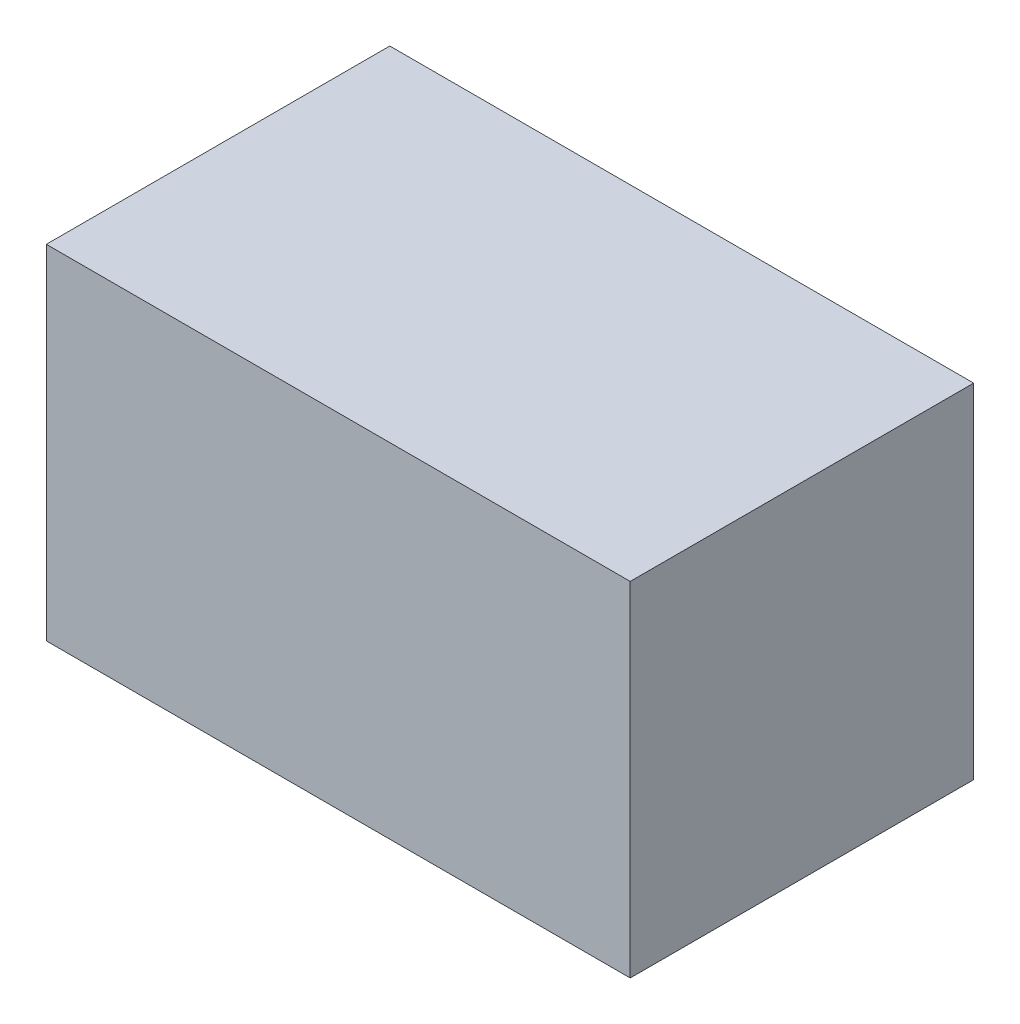
ISO-10303-21;
HEADER;
FILE_DESCRIPTION(('STEP AP214'),'2;1');
FILE_NAME('part.step','',(''),(''),'','','');
FILE_SCHEMA(('AUTOMOTIVE_DESIGN { 1 0 10303 214 1 1 1 1 }'));
ENDSEC;
DATA;
#1=APPLICATION_CONTEXT('core data for automotive mechanical design processes');
#2=APPLICATION_PROTOCOL_DEFINITION('international standard','automotive_design',2000,#1);
#3=PRODUCT_CONTEXT('',#1,'mechanical');
#4=PRODUCT('Part','Part','',(#3));
#5=PRODUCT_RELATED_PRODUCT_CATEGORY('part','',(#4));
#6=PRODUCT_DEFINITION_FORMATION('','',#4);
#7=PRODUCT_DEFINITION_CONTEXT('part definition',#1,'design');
#8=PRODUCT_DEFINITION('design','',#6,#7);
#9=PRODUCT_DEFINITION_SHAPE('','',#8);
#10=(LENGTH_UNIT() NAMED_UNIT(*) SI_UNIT(.MILLI.,.METRE.));
#11=(NAMED_UNIT(*) PLANE_ANGLE_UNIT() SI_UNIT($,.RADIAN.));
#12=(NAMED_UNIT(*) SI_UNIT($,.STERADIAN.) SOLID_ANGLE_UNIT());
#13=UNCERTAINTY_MEASURE_WITH_UNIT(LENGTH_MEASURE(1.E-05),#10,'distance_accuracy_value','');
#14=(GEOMETRIC_REPRESENTATION_CONTEXT(3) GLOBAL_UNCERTAINTY_ASSIGNED_CONTEXT((#13)) GLOBAL_UNIT_ASSIGNED_CONTEXT((#10,
#11,#12)) REPRESENTATION_CONTEXT('',''));
#15=CARTESIAN_POINT('',(0.,0.,0.));
#16=DIRECTION('',(0.,0.,1.));
#17=DIRECTION('',(1.,0.,0.));
#18=AXIS2_PLACEMENT_3D('',#15,#16,#17);
#19=CARTESIAN_POINT('',(-0.42500042,0.2499995,0.));
#20=DIRECTION('',(0.,1.,0.));
#21=DIRECTION('',(0.,0.,1.));
#22=AXIS2_PLACEMENT_3D('',#19,#20,#21);
#23=PLANE('',#22);
#24=DIRECTION('',(0.,0.,-1.));
#25=VECTOR('',#24,1.);
#26=CARTESIAN_POINT('',(0.42500042,0.2499995,0.));
#27=LINE('',#26,#25);
#28=CARTESIAN_POINT('',(0.42500042,0.2499995,0.));
#29=VERTEX_POINT('',#28);
#30=CARTESIAN_POINT('',(0.42500042,0.2499995,0.499999));
#31=VERTEX_POINT('',#30);
#32=EDGE_CURVE('E20',#29,#31,#27,.F.);
#33=ORIENTED_EDGE('',*,*,#32,.F.);
#34=DIRECTION('',(1.,0.,0.));
#35=VECTOR('',#34,1.);
#36=CARTESIAN_POINT('',(0.42500042,0.2499995,0.));
#37=LINE('',#36,#35);
#38=CARTESIAN_POINT('',(-0.42500042,0.2499995,0.));
#39=VERTEX_POINT('',#38);
#40=EDGE_CURVE('E80',#29,#39,#37,.F.);
#41=ORIENTED_EDGE('',*,*,#40,.T.);
#42=DIRECTION('',(0.,0.,1.));
#43=VECTOR('',#42,1.);
#44=CARTESIAN_POINT('',(-0.42500042,0.2499995,0.));
#45=LINE('',#44,#43);
#46=CARTESIAN_POINT('',(-0.42500042,0.2499995,0.499999));
#47=VERTEX_POINT('',#46);
#48=EDGE_CURVE('E68',#47,#39,#45,.F.);
#49=ORIENTED_EDGE('',*,*,#48,.F.);
#50=DIRECTION('',(1.,0.,0.));
#51=VECTOR('',#50,1.);
#52=CARTESIAN_POINT('',(0.42500042,0.2499995,0.499999));
#53=LINE('',#52,#51);
#54=EDGE_CURVE('E56',#31,#47,#53,.F.);
#55=ORIENTED_EDGE('',*,*,#54,.F.);
#56=EDGE_LOOP('',(#33,#41,#49,#55));
#57=FACE_BOUND('',#56,.T.);
#58=ADVANCED_FACE('F17',(#57),#23,.T.);
#59=CARTESIAN_POINT('',(0.42500042,0.2499995,0.));
#60=DIRECTION('',(1.,0.,0.));
#61=DIRECTION('',(0.,0.,-1.));
#62=AXIS2_PLACEMENT_3D('',#59,#60,#61);
#63=PLANE('',#62);
#64=DIRECTION('',(0.,0.,-1.));
#65=VECTOR('',#64,1.);
#66=CARTESIAN_POINT('',(0.42500042,-0.2499995,0.));
#67=LINE('',#66,#65);
#68=CARTESIAN_POINT('',(0.42500042,-0.2499995,0.));
#69=VERTEX_POINT('',#68);
#70=CARTESIAN_POINT('',(0.42500042,-0.2499995,0.499999));
#71=VERTEX_POINT('',#70);
#72=EDGE_CURVE('E83',#69,#71,#67,.F.);
#73=ORIENTED_EDGE('',*,*,#72,.F.);
#74=DIRECTION('',(0.,1.,0.));
#75=VECTOR('',#74,1.);
#76=CARTESIAN_POINT('',(0.42500042,-0.2499995,0.));
#77=LINE('',#76,#75);
#78=EDGE_CURVE('E65',#69,#29,#77,.T.);
#79=ORIENTED_EDGE('',*,*,#78,.T.);
#80=ORIENTED_EDGE('',*,*,#32,.T.);
#81=DIRECTION('',(0.,1.,0.));
#82=VECTOR('',#81,1.);
#83=CARTESIAN_POINT('',(0.42500042,-0.2499995,0.499999));
#84=LINE('',#83,#82);
#85=EDGE_CURVE('E62',#71,#31,#84,.T.);
#86=ORIENTED_EDGE('',*,*,#85,.F.);
#87=EDGE_LOOP('',(#73,#79,#80,#86));
#88=FACE_BOUND('',#87,.T.);
#89=ADVANCED_FACE('F61',(#88),#63,.T.);
#90=CARTESIAN_POINT('',(0.42500042,-0.2499995,0.499999));
#91=DIRECTION('',(0.,0.,1.));
#92=DIRECTION('',(1.,0.,0.));
#93=AXIS2_PLACEMENT_3D('',#90,#91,#92);
#94=PLANE('',#93);
#95=DIRECTION('',(0.,1.,0.));
#96=VECTOR('',#95,1.);
#97=CARTESIAN_POINT('',(-0.42500042,-0.2499995,0.499999));
#98=LINE('',#97,#96);
#99=CARTESIAN_POINT('',(-0.42500042,-0.2499995,0.499999));
#100=VERTEX_POINT('',#99);
#101=EDGE_CURVE('E70',#100,#47,#98,.T.);
#102=ORIENTED_EDGE('',*,*,#101,.F.);
#103=DIRECTION('',(1.,0.,0.));
#104=VECTOR('',#103,1.);
#105=CARTESIAN_POINT('',(0.42500042,-0.2499995,0.499999));
#106=LINE('',#105,#104);
#107=EDGE_CURVE('E74',#71,#100,#106,.F.);
#108=ORIENTED_EDGE('',*,*,#107,.F.);
#109=ORIENTED_EDGE('',*,*,#85,.T.);
#110=ORIENTED_EDGE('',*,*,#54,.T.);
#111=EDGE_LOOP('',(#102,#108,#109,#110));
#112=FACE_BOUND('',#111,.T.);
#113=ADVANCED_FACE('F72',(#112),#94,.T.);
#114=CARTESIAN_POINT('',(-0.42500042,-0.2499995,0.));
#115=DIRECTION('',(-1.,0.,0.));
#116=DIRECTION('',(0.,0.,1.));
#117=AXIS2_PLACEMENT_3D('',#114,#115,#116);
#118=PLANE('',#117);
#119=ORIENTED_EDGE('',*,*,#48,.T.);
#120=DIRECTION('',(0.,1.,0.));
#121=VECTOR('',#120,1.);
#122=CARTESIAN_POINT('',(-0.42500042,-0.2499995,0.));
#123=LINE('',#122,#121);
#124=CARTESIAN_POINT('',(-0.42500042,-0.2499995,0.));
#125=VERTEX_POINT('',#124);
#126=EDGE_CURVE('E35',#39,#125,#123,.F.);
#127=ORIENTED_EDGE('',*,*,#126,.T.);
#128=DIRECTION('',(0.,0.,-1.));
#129=VECTOR('',#128,1.);
#130=CARTESIAN_POINT('',(-0.42500042,-0.2499995,0.));
#131=LINE('',#130,#129);
#132=EDGE_CURVE('E26',#100,#125,#131,.T.);
#133=ORIENTED_EDGE('',*,*,#132,.F.);
#134=ORIENTED_EDGE('',*,*,#101,.T.);
#135=EDGE_LOOP('',(#119,#127,#133,#134));
#136=FACE_BOUND('',#135,.T.);
#137=ADVANCED_FACE('F89',(#136),#118,.T.);
#138=CARTESIAN_POINT('',(0.42500042,-0.2499995,0.));
#139=DIRECTION('',(0.,0.,1.));
#140=DIRECTION('',(1.,0.,0.));
#141=AXIS2_PLACEMENT_3D('',#138,#139,#140);
#142=PLANE('',#141);
#143=ORIENTED_EDGE('',*,*,#126,.F.);
#144=ORIENTED_EDGE('',*,*,#40,.F.);
#145=ORIENTED_EDGE('',*,*,#78,.F.);
#146=DIRECTION('',(1.,0.,0.));
#147=VECTOR('',#146,1.);
#148=CARTESIAN_POINT('',(0.42500042,-0.2499995,0.));
#149=LINE('',#148,#147);
#150=EDGE_CURVE('E11',#125,#69,#149,.T.);
#151=ORIENTED_EDGE('',*,*,#150,.F.);
#152=EDGE_LOOP('',(#143,#144,#145,#151));
#153=FACE_BOUND('',#152,.T.);
#154=ADVANCED_FACE('F91',(#153),#142,.F.);
#155=CARTESIAN_POINT('',(0.42500042,-0.2499995,0.));
#156=DIRECTION('',(0.,-1.,0.));
#157=DIRECTION('',(0.,0.,-1.));
#158=AXIS2_PLACEMENT_3D('',#155,#156,#157);
#159=PLANE('',#158);
#160=ORIENTED_EDGE('',*,*,#132,.T.);
#161=ORIENTED_EDGE('',*,*,#150,.T.);
#162=ORIENTED_EDGE('',*,*,#72,.T.);
#163=ORIENTED_EDGE('',*,*,#107,.T.);
#164=EDGE_LOOP('',(#160,#161,#162,#163));
#165=FACE_BOUND('',#164,.T.);
#166=ADVANCED_FACE('F88',(#165),#159,.T.);
#167=CLOSED_SHELL('',(#58,#89,#113,#137,#154,#166));
#168=MANIFOLD_SOLID_BREP('B1',#167);
#169=ADVANCED_BREP_SHAPE_REPRESENTATION('',(#18,#168),#14);
#170=SHAPE_DEFINITION_REPRESENTATION(#9,#169);
ENDSEC;
END-ISO-10303-21;
